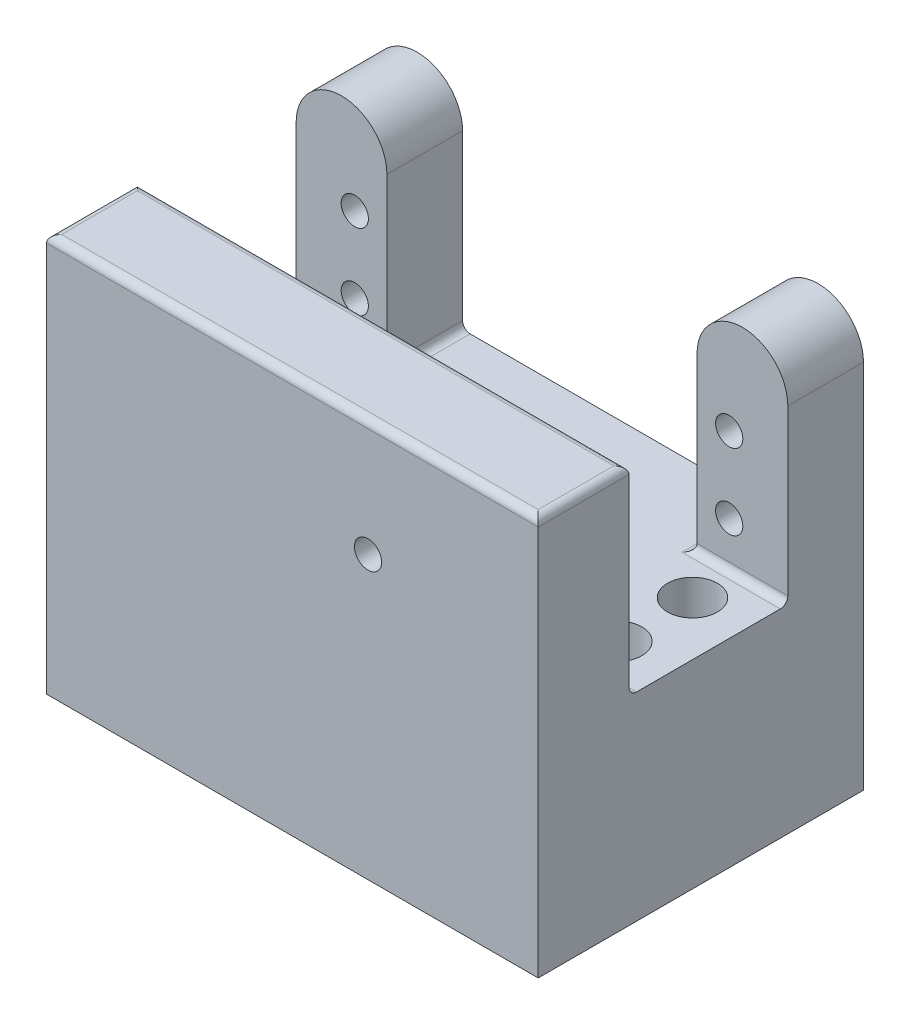
ISO-10303-21;
HEADER;
FILE_DESCRIPTION(('STEP AP214'),'2;1');
FILE_NAME('part.step','',(''),(''),'','','');
FILE_SCHEMA(('AUTOMOTIVE_DESIGN { 1 0 10303 214 1 1 1 1 }'));
ENDSEC;
DATA;
#1=APPLICATION_CONTEXT('core data for automotive mechanical design processes');
#2=APPLICATION_PROTOCOL_DEFINITION('international standard','automotive_design',2000,#1);
#3=PRODUCT_CONTEXT('',#1,'mechanical');
#4=PRODUCT('Part','Part','',(#3));
#5=PRODUCT_RELATED_PRODUCT_CATEGORY('part','',(#4));
#6=PRODUCT_DEFINITION_FORMATION('','',#4);
#7=PRODUCT_DEFINITION_CONTEXT('part definition',#1,'design');
#8=PRODUCT_DEFINITION('design','',#6,#7);
#9=PRODUCT_DEFINITION_SHAPE('','',#8);
#10=(LENGTH_UNIT() NAMED_UNIT(*) SI_UNIT(.MILLI.,.METRE.));
#11=(NAMED_UNIT(*) PLANE_ANGLE_UNIT() SI_UNIT($,.RADIAN.));
#12=(NAMED_UNIT(*) SI_UNIT($,.STERADIAN.) SOLID_ANGLE_UNIT());
#13=UNCERTAINTY_MEASURE_WITH_UNIT(LENGTH_MEASURE(1.E-05),#10,'distance_accuracy_value','');
#14=(GEOMETRIC_REPRESENTATION_CONTEXT(3) GLOBAL_UNCERTAINTY_ASSIGNED_CONTEXT((#13)) GLOBAL_UNIT_ASSIGNED_CONTEXT((#10,
#11,#12)) REPRESENTATION_CONTEXT('',''));
#15=CARTESIAN_POINT('',(0.,0.,0.));
#16=DIRECTION('',(0.,0.,1.));
#17=DIRECTION('',(1.,0.,0.));
#18=AXIS2_PLACEMENT_3D('',#15,#16,#17);
#19=CARTESIAN_POINT('',(0.,0.,31.));
#20=DIRECTION('',(0.,0.,1.));
#21=DIRECTION('',(1.,0.,0.));
#22=AXIS2_PLACEMENT_3D('',#19,#20,#21);
#23=PLANE('',#22);
#24=CARTESIAN_POINT('',(-16.5,2.55301226726425,31.));
#25=DIRECTION('',(0.,0.,1.));
#26=DIRECTION('',(1.,0.,0.));
#27=AXIS2_PLACEMENT_3D('',#24,#25,#26);
#28=CIRCLE('',#27,1.79999999999999);
#29=CARTESIAN_POINT('',(-14.7,2.55301226726425,31.));
#30=VERTEX_POINT('',#29);
#31=EDGE_CURVE('E363',#30,#30,#28,.T.);
#32=ORIENTED_EDGE('',*,*,#31,.T.);
#33=EDGE_LOOP('',(#32));
#34=FACE_BOUND('',#33,.T.);
#35=DIRECTION('',(0.,-1.,0.));
#36=VECTOR('',#35,1.);
#37=CARTESIAN_POINT('',(-59.,-20.6976744186047,31.));
#38=LINE('',#37,#36);
#39=CARTESIAN_POINT('',(-59.,16.9392946847438,31.));
#40=VERTEX_POINT('',#39);
#41=CARTESIAN_POINT('',(-59.,-7.44767441860465,31.));
#42=VERTEX_POINT('',#41);
#43=EDGE_CURVE('E251',#40,#42,#38,.T.);
#44=ORIENTED_EDGE('',*,*,#43,.F.);
#45=DIRECTION('',(-1.,0.,0.));
#46=VECTOR('',#45,1.);
#47=CARTESIAN_POINT('',(0.,16.9392946847438,31.));
#48=LINE('',#47,#46);
#49=CARTESIAN_POINT('',(6.00000000000001,16.9392946847438,31.));
#50=VERTEX_POINT('',#49);
#51=EDGE_CURVE('E294',#40,#50,#48,.F.);
#52=ORIENTED_EDGE('',*,*,#51,.T.);
#53=DIRECTION('',(0.,1.,0.));
#54=VECTOR('',#53,1.);
#55=CARTESIAN_POINT('',(6.00000000000001,-20.6976744186046,31.));
#56=LINE('',#55,#54);
#57=CARTESIAN_POINT('',(6.00000000000001,-7.44767441860465,31.));
#58=VERTEX_POINT('',#57);
#59=EDGE_CURVE('E246',#58,#50,#56,.T.);
#60=ORIENTED_EDGE('',*,*,#59,.F.);
#61=DIRECTION('',(1.,0.,0.));
#62=VECTOR('',#61,1.);
#63=CARTESIAN_POINT('',(0.,-7.44767441860465,31.));
#64=LINE('',#63,#62);
#65=EDGE_CURVE('E292',#58,#42,#64,.F.);
#66=ORIENTED_EDGE('',*,*,#65,.T.);
#67=EDGE_LOOP('',(#44,#52,#60,#66));
#68=FACE_BOUND('',#67,.T.);
#69=ADVANCED_FACE('F37',(#34,#68),#23,.F.);
#70=CARTESIAN_POINT('',(-6.,14.3023255813954,10.));
#71=DIRECTION('',(1.,0.,0.));
#72=DIRECTION('',(0.,1.,0.));
#73=AXIS2_PLACEMENT_3D('',#70,#71,#72);
#74=PLANE('',#73);
#75=DIRECTION('',(0.,-1.,0.));
#76=VECTOR('',#75,1.);
#77=CARTESIAN_POINT('',(-6.,14.3023255813954,0.));
#78=LINE('',#77,#76);
#79=CARTESIAN_POINT('',(-6.,14.3023255813954,0.));
#80=VERTEX_POINT('',#79);
#81=CARTESIAN_POINT('',(-6.,-7.44767441860465,0.));
#82=VERTEX_POINT('',#81);
#83=EDGE_CURVE('E272',#80,#82,#78,.T.);
#84=ORIENTED_EDGE('',*,*,#83,.T.);
#85=DIRECTION('',(0.,0.,1.));
#86=VECTOR('',#85,1.);
#87=CARTESIAN_POINT('',(-6.,-7.44767441860465,10.));
#88=LINE('',#87,#86);
#89=CARTESIAN_POINT('',(-6.,-7.44767441860465,10.));
#90=VERTEX_POINT('',#89);
#91=EDGE_CURVE('E317',#82,#90,#88,.T.);
#92=ORIENTED_EDGE('',*,*,#91,.T.);
#93=DIRECTION('',(0.,-1.,0.));
#94=VECTOR('',#93,1.);
#95=CARTESIAN_POINT('',(-6.,14.3023255813954,10.));
#96=LINE('',#95,#94);
#97=CARTESIAN_POINT('',(-6.,14.3023255813954,10.));
#98=VERTEX_POINT('',#97);
#99=EDGE_CURVE('E264',#98,#90,#96,.T.);
#100=ORIENTED_EDGE('',*,*,#99,.F.);
#101=DIRECTION('',(0.,0.,-1.));
#102=VECTOR('',#101,1.);
#103=CARTESIAN_POINT('',(-6.,14.3023255813954,10.));
#104=LINE('',#103,#102);
#105=EDGE_CURVE('E277',#98,#80,#104,.T.);
#106=ORIENTED_EDGE('',*,*,#105,.T.);
#107=EDGE_LOOP('',(#84,#92,#100,#106));
#108=FACE_BOUND('',#107,.T.);
#109=ADVANCED_FACE('F417',(#108),#74,.F.);
#110=CARTESIAN_POINT('',(-47.,-20.6976744186046,31.));
#111=DIRECTION('',(-1.,0.,0.));
#112=DIRECTION('',(0.,0.,1.));
#113=AXIS2_PLACEMENT_3D('',#110,#111,#112);
#114=PLANE('',#113);
#115=DIRECTION('',(0.,-1.,0.));
#116=VECTOR('',#115,1.);
#117=CARTESIAN_POINT('',(-47.,14.3023255813954,10.));
#118=LINE('',#117,#116);
#119=CARTESIAN_POINT('',(-47.,14.3023255813954,10.));
#120=VERTEX_POINT('',#119);
#121=CARTESIAN_POINT('',(-47.,-7.44767441860465,10.));
#122=VERTEX_POINT('',#121);
#123=EDGE_CURVE('E236',#120,#122,#118,.T.);
#124=ORIENTED_EDGE('',*,*,#123,.T.);
#125=DIRECTION('',(0.,0.,1.));
#126=VECTOR('',#125,1.);
#127=CARTESIAN_POINT('',(-47.,-7.44767441860465,31.));
#128=LINE('',#127,#126);
#129=CARTESIAN_POINT('',(-47.,-7.44767441860465,0.));
#130=VERTEX_POINT('',#129);
#131=EDGE_CURVE('E54',#122,#130,#128,.F.);
#132=ORIENTED_EDGE('',*,*,#131,.T.);
#133=DIRECTION('',(0.,-1.,0.));
#134=VECTOR('',#133,1.);
#135=CARTESIAN_POINT('',(-47.,14.3023255813954,0.));
#136=LINE('',#135,#134);
#137=CARTESIAN_POINT('',(-47.,14.3023255813954,0.));
#138=VERTEX_POINT('',#137);
#139=EDGE_CURVE('E176',#138,#130,#136,.T.);
#140=ORIENTED_EDGE('',*,*,#139,.F.);
#141=DIRECTION('',(0.,0.,-1.));
#142=VECTOR('',#141,1.);
#143=CARTESIAN_POINT('',(-47.,14.3023255813954,10.));
#144=LINE('',#143,#142);
#145=EDGE_CURVE('E238',#120,#138,#144,.T.);
#146=ORIENTED_EDGE('',*,*,#145,.F.);
#147=EDGE_LOOP('',(#124,#132,#140,#146));
#148=FACE_BOUND('',#147,.T.);
#149=ADVANCED_FACE('F424',(#148),#114,.F.);
#150=CARTESIAN_POINT('',(0.,14.3023255813954,10.));
#151=DIRECTION('',(0.,0.,-1.));
#152=DIRECTION('',(-1.,0.,0.));
#153=AXIS2_PLACEMENT_3D('',#150,#151,#152);
#154=CYLINDRICAL_SURFACE('',#153,6.);
#155=CARTESIAN_POINT('',(0.,14.3023255813954,0.));
#156=DIRECTION('',(0.,0.,1.));
#157=DIRECTION('',(-1.,0.,0.));
#158=AXIS2_PLACEMENT_3D('',#155,#156,#157);
#159=CIRCLE('',#158,6.);
#160=CARTESIAN_POINT('',(6.,14.3023255813954,0.));
#161=VERTEX_POINT('',#160);
#162=EDGE_CURVE('E260',#161,#80,#159,.T.);
#163=ORIENTED_EDGE('',*,*,#162,.T.);
#164=ORIENTED_EDGE('',*,*,#105,.F.);
#165=CARTESIAN_POINT('',(0.,14.3023255813954,10.));
#166=DIRECTION('',(0.,0.,1.));
#167=DIRECTION('',(-1.,0.,0.));
#168=AXIS2_PLACEMENT_3D('',#165,#166,#167);
#169=CIRCLE('',#168,6.);
#170=CARTESIAN_POINT('',(6.,14.3023255813954,10.));
#171=VERTEX_POINT('',#170);
#172=EDGE_CURVE('E261',#171,#98,#169,.T.);
#173=ORIENTED_EDGE('',*,*,#172,.F.);
#174=DIRECTION('',(0.,0.,-1.));
#175=VECTOR('',#174,1.);
#176=CARTESIAN_POINT('',(6.,14.3023255813954,10.));
#177=LINE('',#176,#175);
#178=EDGE_CURVE('E269',#171,#161,#177,.T.);
#179=ORIENTED_EDGE('',*,*,#178,.T.);
#180=EDGE_LOOP('',(#163,#164,#173,#179));
#181=FACE_BOUND('',#180,.T.);
#182=ADVANCED_FACE('F430',(#181),#154,.T.);
#183=CARTESIAN_POINT('',(6.,14.3023255813954,10.));
#184=DIRECTION('',(-1.,0.,0.));
#185=DIRECTION('',(0.,-1.,0.));
#186=AXIS2_PLACEMENT_3D('',#183,#184,#185);
#187=PLANE('',#186);
#188=ORIENTED_EDGE('',*,*,#59,.T.);
#189=DIRECTION('',(0.,0.,-1.));
#190=VECTOR('',#189,1.);
#191=CARTESIAN_POINT('',(6.,16.9392946847438,10.));
#192=LINE('',#191,#190);
#193=CARTESIAN_POINT('',(6.00000000000001,16.9392946847438,43.));
#194=VERTEX_POINT('',#193);
#195=EDGE_CURVE('E296',#50,#194,#192,.F.);
#196=ORIENTED_EDGE('',*,*,#195,.T.);
#197=DIRECTION('',(0.,1.,0.));
#198=VECTOR('',#197,1.);
#199=CARTESIAN_POINT('',(6.00000000000001,-20.6976744186046,43.));
#200=LINE('',#199,#198);
#201=CARTESIAN_POINT('',(6.00000000000001,-34.6976744186046,43.));
#202=VERTEX_POINT('',#201);
#203=EDGE_CURVE('E247',#202,#194,#200,.T.);
#204=ORIENTED_EDGE('',*,*,#203,.F.);
#205=DIRECTION('',(0.,0.,1.));
#206=VECTOR('',#205,1.);
#207=CARTESIAN_POINT('',(6.00000000000001,-34.6976744186046,43.));
#208=LINE('',#207,#206);
#209=CARTESIAN_POINT('',(6.00000000000001,-34.6976744186046,0.));
#210=VERTEX_POINT('',#209);
#211=EDGE_CURVE('E188',#210,#202,#208,.T.);
#212=ORIENTED_EDGE('',*,*,#211,.F.);
#213=DIRECTION('',(0.,1.,0.));
#214=VECTOR('',#213,1.);
#215=CARTESIAN_POINT('',(6.,14.3023255813954,0.));
#216=LINE('',#215,#214);
#217=EDGE_CURVE('E184',#210,#161,#216,.T.);
#218=ORIENTED_EDGE('',*,*,#217,.T.);
#219=ORIENTED_EDGE('',*,*,#178,.F.);
#220=DIRECTION('',(0.,1.,0.));
#221=VECTOR('',#220,1.);
#222=CARTESIAN_POINT('',(6.,14.3023255813954,10.));
#223=LINE('',#222,#221);
#224=CARTESIAN_POINT('',(6.,-7.44767441860465,10.));
#225=VERTEX_POINT('',#224);
#226=EDGE_CURVE('E267',#225,#171,#223,.T.);
#227=ORIENTED_EDGE('',*,*,#226,.F.);
#228=CARTESIAN_POINT('',(6.,-7.44767441860465,11.));
#229=DIRECTION('',(-1.,0.,0.));
#230=DIRECTION('',(0.,-1.,0.));
#231=AXIS2_PLACEMENT_3D('',#228,#229,#230);
#232=CIRCLE('',#231,1.);
#233=CARTESIAN_POINT('',(6.00000000000001,-8.44767441860465,11.));
#234=VERTEX_POINT('',#233);
#235=EDGE_CURVE('E322',#225,#234,#232,.T.);
#236=ORIENTED_EDGE('',*,*,#235,.T.);
#237=DIRECTION('',(0.,0.,-1.));
#238=VECTOR('',#237,1.);
#239=CARTESIAN_POINT('',(6.00000000000001,-8.44767441860465,31.));
#240=LINE('',#239,#238);
#241=CARTESIAN_POINT('',(6.00000000000001,-8.44767441860465,30.));
#242=VERTEX_POINT('',#241);
#243=EDGE_CURVE('E253',#242,#234,#240,.T.);
#244=ORIENTED_EDGE('',*,*,#243,.F.);
#245=CARTESIAN_POINT('',(6.00000000000001,-7.44767441860465,30.));
#246=DIRECTION('',(-1.,0.,0.));
#247=DIRECTION('',(0.,-1.,0.));
#248=AXIS2_PLACEMENT_3D('',#245,#246,#247);
#249=CIRCLE('',#248,1.);
#250=EDGE_CURVE('E46',#242,#58,#249,.T.);
#251=ORIENTED_EDGE('',*,*,#250,.T.);
#252=EDGE_LOOP('',(#188,#196,#204,#212,#218,#219,#227,#236,#244,#251));
#253=FACE_BOUND('',#252,.T.);
#254=ADVANCED_FACE('F620',(#253),#187,.F.);
#255=CARTESIAN_POINT('',(0.,14.3023255813954,10.));
#256=DIRECTION('',(0.,0.,-1.));
#257=DIRECTION('',(-1.,0.,0.));
#258=AXIS2_PLACEMENT_3D('',#255,#256,#257);
#259=PLANE('',#258);
#260=CARTESIAN_POINT('',(-1.75,7.55218083966562,10.));
#261=DIRECTION('',(0.,0.,-1.));
#262=DIRECTION('',(-1.,0.,0.));
#263=AXIS2_PLACEMENT_3D('',#260,#261,#262);
#264=CIRCLE('',#263,1.8);
#265=CARTESIAN_POINT('',(-3.55,7.55218083966562,10.));
#266=VERTEX_POINT('',#265);
#267=EDGE_CURVE('E208',#266,#266,#264,.F.);
#268=ORIENTED_EDGE('',*,*,#267,.F.);
#269=EDGE_LOOP('',(#268));
#270=FACE_BOUND('',#269,.T.);
#271=CARTESIAN_POINT('',(-1.75,-2.44781916033438,10.));
#272=DIRECTION('',(0.,0.,-1.));
#273=DIRECTION('',(-1.,0.,0.));
#274=AXIS2_PLACEMENT_3D('',#271,#272,#273);
#275=CIRCLE('',#274,1.8);
#276=CARTESIAN_POINT('',(-3.55,-2.44781916033438,10.));
#277=VERTEX_POINT('',#276);
#278=EDGE_CURVE('E214',#277,#277,#275,.F.);
#279=ORIENTED_EDGE('',*,*,#278,.F.);
#280=EDGE_LOOP('',(#279));
#281=FACE_BOUND('',#280,.T.);
#282=ORIENTED_EDGE('',*,*,#99,.T.);
#283=DIRECTION('',(1.,0.,0.));
#284=VECTOR('',#283,1.);
#285=CARTESIAN_POINT('',(0.,-7.44767441860465,10.));
#286=LINE('',#285,#284);
#287=EDGE_CURVE('E314',#90,#225,#286,.T.);
#288=ORIENTED_EDGE('',*,*,#287,.T.);
#289=ORIENTED_EDGE('',*,*,#226,.T.);
#290=ORIENTED_EDGE('',*,*,#172,.T.);
#291=EDGE_LOOP('',(#282,#288,#289,#290));
#292=FACE_BOUND('',#291,.T.);
#293=ADVANCED_FACE('F608',(#270,#281,#292),#259,.F.);
#294=CARTESIAN_POINT('',(0.,14.3023255813954,0.));
#295=DIRECTION('',(0.,0.,-1.));
#296=DIRECTION('',(-1.,0.,0.));
#297=AXIS2_PLACEMENT_3D('',#294,#295,#296);
#298=PLANE('',#297);
#299=CARTESIAN_POINT('',(-1.75,7.55218083966562,0.));
#300=DIRECTION('',(0.,0.,-1.));
#301=DIRECTION('',(-1.,0.,0.));
#302=AXIS2_PLACEMENT_3D('',#299,#300,#301);
#303=CIRCLE('',#302,1.8);
#304=CARTESIAN_POINT('',(-3.55,7.55218083966562,0.));
#305=VERTEX_POINT('',#304);
#306=EDGE_CURVE('E207',#305,#305,#303,.T.);
#307=ORIENTED_EDGE('',*,*,#306,.F.);
#308=EDGE_LOOP('',(#307));
#309=FACE_BOUND('',#308,.T.);
#310=CARTESIAN_POINT('',(-1.75,-2.44781916033438,0.));
#311=DIRECTION('',(0.,0.,-1.));
#312=DIRECTION('',(-1.,0.,0.));
#313=AXIS2_PLACEMENT_3D('',#310,#311,#312);
#314=CIRCLE('',#313,1.8);
#315=CARTESIAN_POINT('',(-3.55,-2.44781916033438,0.));
#316=VERTEX_POINT('',#315);
#317=EDGE_CURVE('E211',#316,#316,#314,.T.);
#318=ORIENTED_EDGE('',*,*,#317,.F.);
#319=EDGE_LOOP('',(#318));
#320=FACE_BOUND('',#319,.T.);
#321=ORIENTED_EDGE('',*,*,#162,.F.);
#322=ORIENTED_EDGE('',*,*,#217,.F.);
#323=DIRECTION('',(1.,0.,0.));
#324=VECTOR('',#323,1.);
#325=CARTESIAN_POINT('',(-59.,-34.6976744186046,0.));
#326=LINE('',#325,#324);
#327=CARTESIAN_POINT('',(-59.,-34.6976744186046,0.));
#328=VERTEX_POINT('',#327);
#329=EDGE_CURVE('E180',#328,#210,#326,.T.);
#330=ORIENTED_EDGE('',*,*,#329,.F.);
#331=DIRECTION('',(0.,1.,0.));
#332=VECTOR('',#331,1.);
#333=CARTESIAN_POINT('',(-59.,14.3023255813954,0.));
#334=LINE('',#333,#332);
#335=CARTESIAN_POINT('',(-59.,14.3023255813954,0.));
#336=VERTEX_POINT('',#335);
#337=EDGE_CURVE('E166',#328,#336,#334,.T.);
#338=ORIENTED_EDGE('',*,*,#337,.T.);
#339=CARTESIAN_POINT('',(-53.,14.3023255813954,0.));
#340=DIRECTION('',(0.,0.,-1.));
#341=DIRECTION('',(1.,0.,0.));
#342=AXIS2_PLACEMENT_3D('',#339,#340,#341);
#343=CIRCLE('',#342,6.);
#344=EDGE_CURVE('E177',#336,#138,#343,.T.);
#345=ORIENTED_EDGE('',*,*,#344,.T.);
#346=ORIENTED_EDGE('',*,*,#139,.T.);
#347=CARTESIAN_POINT('',(-46.,-7.44767441860465,0.));
#348=DIRECTION('',(0.,0.,-1.));
#349=DIRECTION('',(-1.,0.,0.));
#350=AXIS2_PLACEMENT_3D('',#347,#348,#349);
#351=CIRCLE('',#350,1.);
#352=CARTESIAN_POINT('',(-46.,-8.44767441860465,0.));
#353=VERTEX_POINT('',#352);
#354=EDGE_CURVE('E325',#130,#353,#351,.F.);
#355=ORIENTED_EDGE('',*,*,#354,.T.);
#356=DIRECTION('',(1.,0.,0.));
#357=VECTOR('',#356,1.);
#358=CARTESIAN_POINT('',(-5.99999999999999,-8.44767441860465,0.));
#359=LINE('',#358,#357);
#360=CARTESIAN_POINT('',(-7.,-8.44767441860465,0.));
#361=VERTEX_POINT('',#360);
#362=EDGE_CURVE('E205',#353,#361,#359,.T.);
#363=ORIENTED_EDGE('',*,*,#362,.T.);
#364=CARTESIAN_POINT('',(-7.,-7.44767441860465,0.));
#365=DIRECTION('',(0.,0.,-1.));
#366=DIRECTION('',(-1.,0.,0.));
#367=AXIS2_PLACEMENT_3D('',#364,#365,#366);
#368=CIRCLE('',#367,1.);
#369=EDGE_CURVE('E62',#361,#82,#368,.F.);
#370=ORIENTED_EDGE('',*,*,#369,.T.);
#371=ORIENTED_EDGE('',*,*,#83,.F.);
#372=EDGE_LOOP('',(#321,#322,#330,#338,#345,#346,#355,#363,#370,#371));
#373=FACE_BOUND('',#372,.T.);
#374=CARTESIAN_POINT('',(-51.25,8.00000000000001,0.));
#375=DIRECTION('',(0.,0.,-1.));
#376=DIRECTION('',(-1.,0.,0.));
#377=AXIS2_PLACEMENT_3D('',#374,#375,#376);
#378=CIRCLE('',#377,1.8);
#379=CARTESIAN_POINT('',(-53.05,8.00000000000001,0.));
#380=VERTEX_POINT('',#379);
#381=EDGE_CURVE('E217',#380,#380,#378,.T.);
#382=ORIENTED_EDGE('',*,*,#381,.F.);
#383=EDGE_LOOP('',(#382));
#384=FACE_BOUND('',#383,.T.);
#385=CARTESIAN_POINT('',(-51.25,-1.99999999999999,0.));
#386=DIRECTION('',(0.,0.,-1.));
#387=DIRECTION('',(-1.,0.,0.));
#388=AXIS2_PLACEMENT_3D('',#385,#386,#387);
#389=CIRCLE('',#388,1.8);
#390=CARTESIAN_POINT('',(-53.05,-1.99999999999999,0.));
#391=VERTEX_POINT('',#390);
#392=EDGE_CURVE('E225',#391,#391,#389,.T.);
#393=ORIENTED_EDGE('',*,*,#392,.F.);
#394=EDGE_LOOP('',(#393));
#395=FACE_BOUND('',#394,.T.);
#396=ADVANCED_FACE('F182',(#309,#320,#373,#384,#395),#298,.T.);
#397=CARTESIAN_POINT('',(-5.99999999999999,-8.44767441860465,31.));
#398=DIRECTION('',(0.,1.,0.));
#399=DIRECTION('',(0.,0.,1.));
#400=AXIS2_PLACEMENT_3D('',#397,#398,#399);
#401=PLANE('',#400);
#402=CARTESIAN_POINT('',(-1.09999999999998,-8.44767441860465,15.5));
#403=DIRECTION('',(0.,1.,0.));
#404=DIRECTION('',(0.,0.,1.));
#405=AXIS2_PLACEMENT_3D('',#402,#403,#404);
#406=CIRCLE('',#405,3.29999999999998);
#407=CARTESIAN_POINT('',(-1.09999999999998,-8.44767441860465,18.8));
#408=VERTEX_POINT('',#407);
#409=EDGE_CURVE('E357',#408,#408,#406,.T.);
#410=ORIENTED_EDGE('',*,*,#409,.F.);
#411=EDGE_LOOP('',(#410));
#412=FACE_BOUND('',#411,.T.);
#413=CARTESIAN_POINT('',(-1.09999999999998,-8.44767441860465,25.5));
#414=DIRECTION('',(0.,1.,0.));
#415=DIRECTION('',(0.,0.,1.));
#416=AXIS2_PLACEMENT_3D('',#413,#414,#415);
#417=CIRCLE('',#416,3.29999999999998);
#418=CARTESIAN_POINT('',(-1.09999999999998,-8.44767441860465,28.8));
#419=VERTEX_POINT('',#418);
#420=EDGE_CURVE('E41',#419,#419,#417,.T.);
#421=ORIENTED_EDGE('',*,*,#420,.F.);
#422=EDGE_LOOP('',(#421));
#423=FACE_BOUND('',#422,.T.);
#424=CARTESIAN_POINT('',(-51.9,-8.44767441860465,15.5));
#425=DIRECTION('',(0.,1.,0.));
#426=DIRECTION('',(0.,0.,1.));
#427=AXIS2_PLACEMENT_3D('',#424,#425,#426);
#428=CIRCLE('',#427,3.29999999999999);
#429=CARTESIAN_POINT('',(-51.9,-8.44767441860465,18.8));
#430=VERTEX_POINT('',#429);
#431=EDGE_CURVE('E344',#430,#430,#428,.T.);
#432=ORIENTED_EDGE('',*,*,#431,.F.);
#433=EDGE_LOOP('',(#432));
#434=FACE_BOUND('',#433,.T.);
#435=CARTESIAN_POINT('',(-51.9,-8.44767441860465,25.5));
#436=DIRECTION('',(0.,1.,0.));
#437=DIRECTION('',(0.,0.,1.));
#438=AXIS2_PLACEMENT_3D('',#435,#436,#437);
#439=CIRCLE('',#438,3.29999999999999);
#440=CARTESIAN_POINT('',(-51.9,-8.44767441860465,28.8));
#441=VERTEX_POINT('',#440);
#442=EDGE_CURVE('E339',#441,#441,#439,.T.);
#443=ORIENTED_EDGE('',*,*,#442,.F.);
#444=EDGE_LOOP('',(#443));
#445=FACE_BOUND('',#444,.T.);
#446=ORIENTED_EDGE('',*,*,#243,.T.);
#447=DIRECTION('',(1.,0.,0.));
#448=VECTOR('',#447,1.);
#449=CARTESIAN_POINT('',(-5.99999999999999,-8.44767441860465,11.));
#450=LINE('',#449,#448);
#451=CARTESIAN_POINT('',(-7.,-8.44767441860465,11.));
#452=VERTEX_POINT('',#451);
#453=EDGE_CURVE('E310',#234,#452,#450,.F.);
#454=ORIENTED_EDGE('',*,*,#453,.T.);
#455=DIRECTION('',(0.,0.,1.));
#456=VECTOR('',#455,1.);
#457=CARTESIAN_POINT('',(-7.,-8.44767441860465,31.));
#458=LINE('',#457,#456);
#459=EDGE_CURVE('E308',#452,#361,#458,.F.);
#460=ORIENTED_EDGE('',*,*,#459,.T.);
#461=ORIENTED_EDGE('',*,*,#362,.F.);
#462=DIRECTION('',(0.,0.,1.));
#463=VECTOR('',#462,1.);
#464=CARTESIAN_POINT('',(-46.,-8.44767441860465,31.));
#465=LINE('',#464,#463);
#466=CARTESIAN_POINT('',(-46.,-8.44767441860465,11.));
#467=VERTEX_POINT('',#466);
#468=EDGE_CURVE('E303',#353,#467,#465,.T.);
#469=ORIENTED_EDGE('',*,*,#468,.T.);
#470=DIRECTION('',(-1.,0.,0.));
#471=VECTOR('',#470,1.);
#472=CARTESIAN_POINT('',(-5.99999999999999,-8.44767441860465,11.));
#473=LINE('',#472,#471);
#474=CARTESIAN_POINT('',(-59.,-8.44767441860465,11.));
#475=VERTEX_POINT('',#474);
#476=EDGE_CURVE('E305',#467,#475,#473,.T.);
#477=ORIENTED_EDGE('',*,*,#476,.T.);
#478=DIRECTION('',(0.,0.,-1.));
#479=VECTOR('',#478,1.);
#480=CARTESIAN_POINT('',(-59.,-8.44767441860465,31.));
#481=LINE('',#480,#479);
#482=CARTESIAN_POINT('',(-59.,-8.44767441860465,30.));
#483=VERTEX_POINT('',#482);
#484=EDGE_CURVE('E243',#483,#475,#481,.T.);
#485=ORIENTED_EDGE('',*,*,#484,.F.);
#486=DIRECTION('',(1.,0.,0.));
#487=VECTOR('',#486,1.);
#488=CARTESIAN_POINT('',(-5.99999999999999,-8.44767441860465,30.));
#489=LINE('',#488,#487);
#490=EDGE_CURVE('E300',#483,#242,#489,.T.);
#491=ORIENTED_EDGE('',*,*,#490,.T.);
#492=EDGE_LOOP('',(#446,#454,#460,#461,#469,#477,#485,#491));
#493=FACE_BOUND('',#492,.T.);
#494=ADVANCED_FACE('F407',(#412,#423,#434,#445,#493),#401,.T.);
#495=CARTESIAN_POINT('',(6.00000000000001,17.9392946847438,43.));
#496=DIRECTION('',(0.,-1.,0.));
#497=DIRECTION('',(1.,0.,0.));
#498=AXIS2_PLACEMENT_3D('',#495,#496,#497);
#499=PLANE('',#498);
#500=DIRECTION('',(-1.,0.,0.));
#501=VECTOR('',#500,1.);
#502=CARTESIAN_POINT('',(6.00000000000001,17.9392946847438,42.));
#503=LINE('',#502,#501);
#504=CARTESIAN_POINT('',(-58.,17.9392946847438,42.));
#505=VERTEX_POINT('',#504);
#506=CARTESIAN_POINT('',(5.,17.9392946847438,42.));
#507=VERTEX_POINT('',#506);
#508=EDGE_CURVE('E287',#505,#507,#503,.F.);
#509=ORIENTED_EDGE('',*,*,#508,.T.);
#510=DIRECTION('',(0.,0.,-1.));
#511=VECTOR('',#510,1.);
#512=CARTESIAN_POINT('',(5.,17.9392946847438,43.));
#513=LINE('',#512,#511);
#514=CARTESIAN_POINT('',(5.,17.9392946847438,32.));
#515=VERTEX_POINT('',#514);
#516=EDGE_CURVE('E290',#507,#515,#513,.T.);
#517=ORIENTED_EDGE('',*,*,#516,.T.);
#518=DIRECTION('',(-1.,0.,0.));
#519=VECTOR('',#518,1.);
#520=CARTESIAN_POINT('',(6.00000000000001,17.9392946847438,32.));
#521=LINE('',#520,#519);
#522=CARTESIAN_POINT('',(-58.,17.9392946847438,32.));
#523=VERTEX_POINT('',#522);
#524=EDGE_CURVE('E285',#515,#523,#521,.T.);
#525=ORIENTED_EDGE('',*,*,#524,.T.);
#526=DIRECTION('',(0.,0.,-1.));
#527=VECTOR('',#526,1.);
#528=CARTESIAN_POINT('',(-58.,17.9392946847438,43.));
#529=LINE('',#528,#527);
#530=EDGE_CURVE('E283',#523,#505,#529,.F.);
#531=ORIENTED_EDGE('',*,*,#530,.T.);
#532=EDGE_LOOP('',(#509,#517,#525,#531));
#533=FACE_BOUND('',#532,.T.);
#534=ADVANCED_FACE('F405',(#533),#499,.F.);
#535=CARTESIAN_POINT('',(-59.,-20.6976744186047,43.));
#536=DIRECTION('',(1.,0.,0.));
#537=DIRECTION('',(0.,0.,-1.));
#538=AXIS2_PLACEMENT_3D('',#535,#536,#537);
#539=PLANE('',#538);
#540=DIRECTION('',(0.,-1.,0.));
#541=VECTOR('',#540,1.);
#542=CARTESIAN_POINT('',(-59.,-20.6976744186047,43.));
#543=LINE('',#542,#541);
#544=CARTESIAN_POINT('',(-59.,16.9392946847438,43.));
#545=VERTEX_POINT('',#544);
#546=CARTESIAN_POINT('',(-59.,-34.6976744186046,43.));
#547=VERTEX_POINT('',#546);
#548=EDGE_CURVE('E250',#545,#547,#543,.T.);
#549=ORIENTED_EDGE('',*,*,#548,.F.);
#550=DIRECTION('',(0.,0.,-1.));
#551=VECTOR('',#550,1.);
#552=CARTESIAN_POINT('',(-59.,16.9392946847438,43.));
#553=LINE('',#552,#551);
#554=EDGE_CURVE('E298',#545,#40,#553,.T.);
#555=ORIENTED_EDGE('',*,*,#554,.T.);
#556=ORIENTED_EDGE('',*,*,#43,.T.);
#557=CARTESIAN_POINT('',(-59.,-7.44767441860465,30.));
#558=DIRECTION('',(1.,0.,0.));
#559=DIRECTION('',(0.,0.,-1.));
#560=AXIS2_PLACEMENT_3D('',#557,#558,#559);
#561=CIRCLE('',#560,1.);
#562=EDGE_CURVE('E11',#42,#483,#561,.T.);
#563=ORIENTED_EDGE('',*,*,#562,.T.);
#564=ORIENTED_EDGE('',*,*,#484,.T.);
#565=CARTESIAN_POINT('',(-59.,-7.44767441860465,11.));
#566=DIRECTION('',(1.,0.,0.));
#567=DIRECTION('',(0.,0.,-1.));
#568=AXIS2_PLACEMENT_3D('',#565,#566,#567);
#569=CIRCLE('',#568,1.);
#570=CARTESIAN_POINT('',(-59.,-7.44767441860465,10.));
#571=VERTEX_POINT('',#570);
#572=EDGE_CURVE('E320',#475,#571,#569,.T.);
#573=ORIENTED_EDGE('',*,*,#572,.T.);
#574=DIRECTION('',(0.,1.,0.));
#575=VECTOR('',#574,1.);
#576=CARTESIAN_POINT('',(-59.,14.3023255813954,10.));
#577=LINE('',#576,#575);
#578=CARTESIAN_POINT('',(-59.,14.3023255813954,10.));
#579=VERTEX_POINT('',#578);
#580=EDGE_CURVE('E234',#571,#579,#577,.T.);
#581=ORIENTED_EDGE('',*,*,#580,.T.);
#582=DIRECTION('',(0.,0.,-1.));
#583=VECTOR('',#582,1.);
#584=CARTESIAN_POINT('',(-59.,14.3023255813954,10.));
#585=LINE('',#584,#583);
#586=EDGE_CURVE('E173',#579,#336,#585,.T.);
#587=ORIENTED_EDGE('',*,*,#586,.T.);
#588=ORIENTED_EDGE('',*,*,#337,.F.);
#589=DIRECTION('',(0.,0.,-1.));
#590=VECTOR('',#589,1.);
#591=CARTESIAN_POINT('',(-59.,-34.6976744186046,43.));
#592=LINE('',#591,#590);
#593=EDGE_CURVE('E171',#547,#328,#592,.T.);
#594=ORIENTED_EDGE('',*,*,#593,.F.);
#595=EDGE_LOOP('',(#549,#555,#556,#563,#564,#573,#581,#587,#588,#594));
#596=FACE_BOUND('',#595,.T.);
#597=ADVANCED_FACE('F169',(#596),#539,.F.);
#598=CARTESIAN_POINT('',(0.,0.,43.));
#599=DIRECTION('',(0.,0.,1.));
#600=DIRECTION('',(1.,0.,0.));
#601=AXIS2_PLACEMENT_3D('',#598,#599,#600);
#602=PLANE('',#601);
#603=CARTESIAN_POINT('',(-16.5,2.55301226726425,43.));
#604=DIRECTION('',(0.,0.,1.));
#605=DIRECTION('',(1.,0.,0.));
#606=AXIS2_PLACEMENT_3D('',#603,#604,#605);
#607=CIRCLE('',#606,1.79999999999999);
#608=CARTESIAN_POINT('',(-14.7,2.55301226726425,43.));
#609=VERTEX_POINT('',#608);
#610=EDGE_CURVE('E366',#609,#609,#607,.T.);
#611=ORIENTED_EDGE('',*,*,#610,.F.);
#612=EDGE_LOOP('',(#611));
#613=FACE_BOUND('',#612,.T.);
#614=ORIENTED_EDGE('',*,*,#203,.T.);
#615=DIRECTION('',(-1.,0.,0.));
#616=VECTOR('',#615,1.);
#617=CARTESIAN_POINT('',(-59.,16.9392946847438,43.));
#618=LINE('',#617,#616);
#619=EDGE_CURVE('E280',#194,#545,#618,.T.);
#620=ORIENTED_EDGE('',*,*,#619,.T.);
#621=ORIENTED_EDGE('',*,*,#548,.T.);
#622=DIRECTION('',(-1.,0.,0.));
#623=VECTOR('',#622,1.);
#624=CARTESIAN_POINT('',(-59.,-34.6976744186046,43.));
#625=LINE('',#624,#623);
#626=EDGE_CURVE('E193',#202,#547,#625,.T.);
#627=ORIENTED_EDGE('',*,*,#626,.F.);
#628=EDGE_LOOP('',(#614,#620,#621,#627));
#629=FACE_BOUND('',#628,.T.);
#630=ADVANCED_FACE('F373',(#613,#629),#602,.T.);
#631=CARTESIAN_POINT('',(-53.,14.3023255813954,10.));
#632=DIRECTION('',(0.,0.,-1.));
#633=DIRECTION('',(1.,0.,0.));
#634=AXIS2_PLACEMENT_3D('',#631,#632,#633);
#635=PLANE('',#634);
#636=CARTESIAN_POINT('',(-51.25,8.00000000000001,10.));
#637=DIRECTION('',(0.,0.,-1.));
#638=DIRECTION('',(-1.,0.,0.));
#639=AXIS2_PLACEMENT_3D('',#636,#637,#638);
#640=CIRCLE('',#639,1.8);
#641=CARTESIAN_POINT('',(-53.05,8.00000000000001,10.));
#642=VERTEX_POINT('',#641);
#643=EDGE_CURVE('E222',#642,#642,#640,.T.);
#644=ORIENTED_EDGE('',*,*,#643,.T.);
#645=EDGE_LOOP('',(#644));
#646=FACE_BOUND('',#645,.T.);
#647=CARTESIAN_POINT('',(-51.25,-1.99999999999999,10.));
#648=DIRECTION('',(0.,0.,-1.));
#649=DIRECTION('',(-1.,0.,0.));
#650=AXIS2_PLACEMENT_3D('',#647,#648,#649);
#651=CIRCLE('',#650,1.8);
#652=CARTESIAN_POINT('',(-53.05,-1.99999999999999,10.));
#653=VERTEX_POINT('',#652);
#654=EDGE_CURVE('E228',#653,#653,#651,.T.);
#655=ORIENTED_EDGE('',*,*,#654,.T.);
#656=EDGE_LOOP('',(#655));
#657=FACE_BOUND('',#656,.T.);
#658=ORIENTED_EDGE('',*,*,#580,.F.);
#659=DIRECTION('',(-1.,0.,0.));
#660=VECTOR('',#659,1.);
#661=CARTESIAN_POINT('',(-53.,-7.44767441860465,10.));
#662=LINE('',#661,#660);
#663=EDGE_CURVE('E312',#571,#122,#662,.F.);
#664=ORIENTED_EDGE('',*,*,#663,.T.);
#665=ORIENTED_EDGE('',*,*,#123,.F.);
#666=CARTESIAN_POINT('',(-53.,14.3023255813954,10.));
#667=DIRECTION('',(0.,0.,-1.));
#668=DIRECTION('',(1.,0.,0.));
#669=AXIS2_PLACEMENT_3D('',#666,#667,#668);
#670=CIRCLE('',#669,6.);
#671=EDGE_CURVE('E231',#579,#120,#670,.T.);
#672=ORIENTED_EDGE('',*,*,#671,.F.);
#673=EDGE_LOOP('',(#658,#664,#665,#672));
#674=FACE_BOUND('',#673,.T.);
#675=ADVANCED_FACE('F376',(#646,#657,#674),#635,.F.);
#676=CARTESIAN_POINT('',(-53.,14.3023255813954,10.));
#677=DIRECTION('',(0.,0.,-1.));
#678=DIRECTION('',(-1.,0.,0.));
#679=AXIS2_PLACEMENT_3D('',#676,#677,#678);
#680=CYLINDRICAL_SURFACE('',#679,6.);
#681=ORIENTED_EDGE('',*,*,#344,.F.);
#682=ORIENTED_EDGE('',*,*,#586,.F.);
#683=ORIENTED_EDGE('',*,*,#671,.T.);
#684=ORIENTED_EDGE('',*,*,#145,.T.);
#685=EDGE_LOOP('',(#681,#682,#683,#684));
#686=FACE_BOUND('',#685,.T.);
#687=ADVANCED_FACE('F431',(#686),#680,.T.);
#688=CARTESIAN_POINT('',(-51.25,-1.99999999999999,0.));
#689=DIRECTION('',(0.,0.,-1.));
#690=DIRECTION('',(-1.,0.,0.));
#691=AXIS2_PLACEMENT_3D('',#688,#689,#690);
#692=CYLINDRICAL_SURFACE('',#691,1.8);
#693=ORIENTED_EDGE('',*,*,#654,.F.);
#694=EDGE_LOOP('',(#693));
#695=FACE_BOUND('',#694,.T.);
#696=ORIENTED_EDGE('',*,*,#392,.T.);
#697=EDGE_LOOP('',(#696));
#698=FACE_BOUND('',#697,.T.);
#699=ADVANCED_FACE('F434',(#695,#698),#692,.F.);
#700=CARTESIAN_POINT('',(-51.25,8.00000000000001,0.));
#701=DIRECTION('',(0.,0.,-1.));
#702=DIRECTION('',(-1.,0.,0.));
#703=AXIS2_PLACEMENT_3D('',#700,#701,#702);
#704=CYLINDRICAL_SURFACE('',#703,1.8);
#705=ORIENTED_EDGE('',*,*,#643,.F.);
#706=EDGE_LOOP('',(#705));
#707=FACE_BOUND('',#706,.T.);
#708=ORIENTED_EDGE('',*,*,#381,.T.);
#709=EDGE_LOOP('',(#708));
#710=FACE_BOUND('',#709,.T.);
#711=ADVANCED_FACE('F441',(#707,#710),#704,.F.);
#712=CARTESIAN_POINT('',(-1.75,-2.44781916033438,0.));
#713=DIRECTION('',(0.,0.,-1.));
#714=DIRECTION('',(-1.,0.,0.));
#715=AXIS2_PLACEMENT_3D('',#712,#713,#714);
#716=CYLINDRICAL_SURFACE('',#715,1.8);
#717=ORIENTED_EDGE('',*,*,#278,.T.);
#718=EDGE_LOOP('',(#717));
#719=FACE_BOUND('',#718,.T.);
#720=ORIENTED_EDGE('',*,*,#317,.T.);
#721=EDGE_LOOP('',(#720));
#722=FACE_BOUND('',#721,.T.);
#723=ADVANCED_FACE('F445',(#719,#722),#716,.F.);
#724=CARTESIAN_POINT('',(-1.75,7.55218083966562,0.));
#725=DIRECTION('',(0.,0.,-1.));
#726=DIRECTION('',(-1.,0.,0.));
#727=AXIS2_PLACEMENT_3D('',#724,#725,#726);
#728=CYLINDRICAL_SURFACE('',#727,1.8);
#729=ORIENTED_EDGE('',*,*,#267,.T.);
#730=EDGE_LOOP('',(#729));
#731=FACE_BOUND('',#730,.T.);
#732=ORIENTED_EDGE('',*,*,#306,.T.);
#733=EDGE_LOOP('',(#732));
#734=FACE_BOUND('',#733,.T.);
#735=ADVANCED_FACE('F449',(#731,#734),#728,.F.);
#736=CARTESIAN_POINT('',(0.,-34.6976744186046,0.));
#737=DIRECTION('',(0.,-1.,0.));
#738=DIRECTION('',(0.,0.,-1.));
#739=AXIS2_PLACEMENT_3D('',#736,#737,#738);
#740=PLANE('',#739);
#741=CARTESIAN_POINT('',(-1.09999999999998,-34.6976744186046,15.5));
#742=DIRECTION('',(0.,-1.,0.));
#743=DIRECTION('',(0.,0.,-1.));
#744=AXIS2_PLACEMENT_3D('',#741,#742,#743);
#745=CIRCLE('',#744,3.29999999999999);
#746=CARTESIAN_POINT('',(-1.09999999999998,-34.6976744186046,12.2));
#747=VERTEX_POINT('',#746);
#748=EDGE_CURVE('E360',#747,#747,#745,.T.);
#749=ORIENTED_EDGE('',*,*,#748,.F.);
#750=EDGE_LOOP('',(#749));
#751=FACE_BOUND('',#750,.T.);
#752=CARTESIAN_POINT('',(-1.09999999999998,-34.6976744186046,25.5));
#753=DIRECTION('',(0.,-1.,0.));
#754=DIRECTION('',(0.,0.,-1.));
#755=AXIS2_PLACEMENT_3D('',#752,#753,#754);
#756=CIRCLE('',#755,3.29999999999999);
#757=CARTESIAN_POINT('',(-1.09999999999998,-34.6976744186046,22.2));
#758=VERTEX_POINT('',#757);
#759=EDGE_CURVE('E354',#758,#758,#756,.T.);
#760=ORIENTED_EDGE('',*,*,#759,.F.);
#761=EDGE_LOOP('',(#760));
#762=FACE_BOUND('',#761,.T.);
#763=CARTESIAN_POINT('',(-51.9,-34.6976744186046,15.5));
#764=DIRECTION('',(0.,-1.,0.));
#765=DIRECTION('',(0.,0.,-1.));
#766=AXIS2_PLACEMENT_3D('',#763,#764,#765);
#767=CIRCLE('',#766,3.29999999999999);
#768=CARTESIAN_POINT('',(-51.9,-34.6976744186046,12.2));
#769=VERTEX_POINT('',#768);
#770=EDGE_CURVE('E348',#769,#769,#767,.T.);
#771=ORIENTED_EDGE('',*,*,#770,.F.);
#772=EDGE_LOOP('',(#771));
#773=FACE_BOUND('',#772,.T.);
#774=CARTESIAN_POINT('',(-51.9,-34.6976744186046,25.5));
#775=DIRECTION('',(0.,-1.,0.));
#776=DIRECTION('',(0.,0.,-1.));
#777=AXIS2_PLACEMENT_3D('',#774,#775,#776);
#778=CIRCLE('',#777,3.29999999999999);
#779=CARTESIAN_POINT('',(-51.9,-34.6976744186046,22.2));
#780=VERTEX_POINT('',#779);
#781=EDGE_CURVE('E200',#780,#780,#778,.T.);
#782=ORIENTED_EDGE('',*,*,#781,.F.);
#783=EDGE_LOOP('',(#782));
#784=FACE_BOUND('',#783,.T.);
#785=ORIENTED_EDGE('',*,*,#593,.T.);
#786=ORIENTED_EDGE('',*,*,#329,.T.);
#787=ORIENTED_EDGE('',*,*,#211,.T.);
#788=ORIENTED_EDGE('',*,*,#626,.T.);
#789=EDGE_LOOP('',(#785,#786,#787,#788));
#790=FACE_BOUND('',#789,.T.);
#791=ADVANCED_FACE('F191',(#751,#762,#773,#784,#790),#740,.T.);
#792=CARTESIAN_POINT('',(6.00000000000001,16.9392946847438,32.));
#793=DIRECTION('',(-1.,0.,0.));
#794=DIRECTION('',(0.,-1.,0.));
#795=AXIS2_PLACEMENT_3D('',#792,#793,#794);
#796=CYLINDRICAL_SURFACE('',#795,1.);
#797=CARTESIAN_POINT('',(-58.,16.9392946847438,32.));
#798=DIRECTION('',(0.707106781186547,0.,-0.707106781186547));
#799=DIRECTION('',(-0.707106781186547,0.,-0.707106781186547));
#800=AXIS2_PLACEMENT_3D('',#797,#798,#799);
#801=ELLIPSE('',#800,1.41421356237309,1.);
#802=EDGE_CURVE('E197',#523,#40,#801,.F.);
#803=ORIENTED_EDGE('',*,*,#802,.F.);
#804=ORIENTED_EDGE('',*,*,#524,.F.);
#805=CARTESIAN_POINT('',(5.,16.9392946847438,32.));
#806=DIRECTION('',(-0.707106781186547,0.,-0.707106781186547));
#807=DIRECTION('',(0.707106781186547,0.,-0.707106781186547));
#808=AXIS2_PLACEMENT_3D('',#805,#806,#807);
#809=ELLIPSE('',#808,1.41421356237309,1.);
#810=EDGE_CURVE('E194',#50,#515,#809,.F.);
#811=ORIENTED_EDGE('',*,*,#810,.F.);
#812=ORIENTED_EDGE('',*,*,#51,.F.);
#813=EDGE_LOOP('',(#803,#804,#811,#812));
#814=FACE_BOUND('',#813,.T.);
#815=ADVANCED_FACE('F402',(#814),#796,.T.);
#816=CARTESIAN_POINT('',(5.,16.9392946847438,43.));
#817=DIRECTION('',(0.,0.,-1.));
#818=DIRECTION('',(-1.,0.,0.));
#819=AXIS2_PLACEMENT_3D('',#816,#817,#818);
#820=CYLINDRICAL_SURFACE('',#819,1.);
#821=ORIENTED_EDGE('',*,*,#810,.T.);
#822=ORIENTED_EDGE('',*,*,#516,.F.);
#823=CARTESIAN_POINT('',(5.,16.9392946847438,42.));
#824=DIRECTION('',(0.707106781186547,0.,-0.707106781186547));
#825=DIRECTION('',(-0.707106781186547,0.,-0.707106781186547));
#826=AXIS2_PLACEMENT_3D('',#823,#824,#825);
#827=ELLIPSE('',#826,1.41421356237309,1.);
#828=EDGE_CURVE('E330',#194,#507,#827,.F.);
#829=ORIENTED_EDGE('',*,*,#828,.F.);
#830=ORIENTED_EDGE('',*,*,#195,.F.);
#831=EDGE_LOOP('',(#821,#822,#829,#830));
#832=FACE_BOUND('',#831,.T.);
#833=ADVANCED_FACE('F384',(#832),#820,.T.);
#834=CARTESIAN_POINT('',(-58.,16.9392946847438,43.));
#835=DIRECTION('',(0.,0.,-1.));
#836=DIRECTION('',(-1.,0.,0.));
#837=AXIS2_PLACEMENT_3D('',#834,#835,#836);
#838=CYLINDRICAL_SURFACE('',#837,1.);
#839=ORIENTED_EDGE('',*,*,#802,.T.);
#840=ORIENTED_EDGE('',*,*,#554,.F.);
#841=CARTESIAN_POINT('',(-58.,16.9392946847438,42.));
#842=DIRECTION('',(-0.707106781186547,0.,-0.707106781186547));
#843=DIRECTION('',(0.707106781186547,0.,-0.707106781186547));
#844=AXIS2_PLACEMENT_3D('',#841,#842,#843);
#845=ELLIPSE('',#844,1.41421356237309,1.);
#846=EDGE_CURVE('E328',#505,#545,#845,.F.);
#847=ORIENTED_EDGE('',*,*,#846,.F.);
#848=ORIENTED_EDGE('',*,*,#530,.F.);
#849=EDGE_LOOP('',(#839,#840,#847,#848));
#850=FACE_BOUND('',#849,.T.);
#851=ADVANCED_FACE('F392',(#850),#838,.T.);
#852=CARTESIAN_POINT('',(0.,16.9392946847438,42.));
#853=DIRECTION('',(1.,0.,0.));
#854=DIRECTION('',(0.,1.,0.));
#855=AXIS2_PLACEMENT_3D('',#852,#853,#854);
#856=CYLINDRICAL_SURFACE('',#855,1.);
#857=ORIENTED_EDGE('',*,*,#828,.T.);
#858=ORIENTED_EDGE('',*,*,#508,.F.);
#859=ORIENTED_EDGE('',*,*,#846,.T.);
#860=ORIENTED_EDGE('',*,*,#619,.F.);
#861=EDGE_LOOP('',(#857,#858,#859,#860));
#862=FACE_BOUND('',#861,.T.);
#863=ADVANCED_FACE('F387',(#862),#856,.T.);
#864=CARTESIAN_POINT('',(-46.,-7.44767441860465,31.));
#865=DIRECTION('',(0.,0.,1.));
#866=DIRECTION('',(1.,0.,0.));
#867=AXIS2_PLACEMENT_3D('',#864,#865,#866);
#868=CYLINDRICAL_SURFACE('',#867,1.);
#869=ORIENTED_EDGE('',*,*,#354,.F.);
#870=ORIENTED_EDGE('',*,*,#131,.F.);
#871=CARTESIAN_POINT('',(-46.,-7.44767441860465,11.));
#872=DIRECTION('',(-0.707106781186547,0.,0.707106781186547));
#873=DIRECTION('',(0.707106781186547,0.,0.707106781186547));
#874=AXIS2_PLACEMENT_3D('',#871,#872,#873);
#875=ELLIPSE('',#874,1.41421356237309,1.);
#876=EDGE_CURVE('E331',#467,#122,#875,.F.);
#877=ORIENTED_EDGE('',*,*,#876,.F.);
#878=ORIENTED_EDGE('',*,*,#468,.F.);
#879=EDGE_LOOP('',(#869,#870,#877,#878));
#880=FACE_BOUND('',#879,.T.);
#881=ADVANCED_FACE('F519',(#880),#868,.F.);
#882=CARTESIAN_POINT('',(-5.99999999999999,-7.44767441860465,11.));
#883=DIRECTION('',(-1.,0.,0.));
#884=DIRECTION('',(0.,0.,1.));
#885=AXIS2_PLACEMENT_3D('',#882,#883,#884);
#886=CYLINDRICAL_SURFACE('',#885,1.);
#887=ORIENTED_EDGE('',*,*,#876,.T.);
#888=ORIENTED_EDGE('',*,*,#663,.F.);
#889=ORIENTED_EDGE('',*,*,#572,.F.);
#890=ORIENTED_EDGE('',*,*,#476,.F.);
#891=EDGE_LOOP('',(#887,#888,#889,#890));
#892=FACE_BOUND('',#891,.T.);
#893=ADVANCED_FACE('F512',(#892),#886,.F.);
#894=CARTESIAN_POINT('',(-7.,-7.44767441860465,10.));
#895=DIRECTION('',(0.,0.,1.));
#896=DIRECTION('',(1.,0.,0.));
#897=AXIS2_PLACEMENT_3D('',#894,#895,#896);
#898=CYLINDRICAL_SURFACE('',#897,1.);
#899=ORIENTED_EDGE('',*,*,#369,.F.);
#900=ORIENTED_EDGE('',*,*,#459,.F.);
#901=CARTESIAN_POINT('',(-7.,-7.44767441860465,11.));
#902=DIRECTION('',(0.707106781186547,0.,0.707106781186547));
#903=DIRECTION('',(-0.707106781186547,0.,0.707106781186547));
#904=AXIS2_PLACEMENT_3D('',#901,#902,#903);
#905=ELLIPSE('',#904,1.41421356237309,1.);
#906=EDGE_CURVE('E337',#90,#452,#905,.F.);
#907=ORIENTED_EDGE('',*,*,#906,.F.);
#908=ORIENTED_EDGE('',*,*,#91,.F.);
#909=EDGE_LOOP('',(#899,#900,#907,#908));
#910=FACE_BOUND('',#909,.T.);
#911=ADVANCED_FACE('F504',(#910),#898,.F.);
#912=CARTESIAN_POINT('',(0.,-7.44767441860465,11.));
#913=DIRECTION('',(1.,0.,0.));
#914=DIRECTION('',(0.,0.,-1.));
#915=AXIS2_PLACEMENT_3D('',#912,#913,#914);
#916=CYLINDRICAL_SURFACE('',#915,1.);
#917=ORIENTED_EDGE('',*,*,#906,.T.);
#918=ORIENTED_EDGE('',*,*,#453,.F.);
#919=ORIENTED_EDGE('',*,*,#235,.F.);
#920=ORIENTED_EDGE('',*,*,#287,.F.);
#921=EDGE_LOOP('',(#917,#918,#919,#920));
#922=FACE_BOUND('',#921,.T.);
#923=ADVANCED_FACE('F496',(#922),#916,.F.);
#924=CARTESIAN_POINT('',(-5.99999999999999,-7.44767441860465,30.));
#925=DIRECTION('',(1.,0.,0.));
#926=DIRECTION('',(0.,0.,-1.));
#927=AXIS2_PLACEMENT_3D('',#924,#925,#926);
#928=CYLINDRICAL_SURFACE('',#927,1.);
#929=ORIENTED_EDGE('',*,*,#562,.F.);
#930=ORIENTED_EDGE('',*,*,#65,.F.);
#931=ORIENTED_EDGE('',*,*,#250,.F.);
#932=ORIENTED_EDGE('',*,*,#490,.F.);
#933=EDGE_LOOP('',(#929,#930,#931,#932));
#934=FACE_BOUND('',#933,.T.);
#935=ADVANCED_FACE('F39',(#934),#928,.F.);
#936=CARTESIAN_POINT('',(-51.9,-34.6976744186046,25.5));
#937=DIRECTION('',(0.,-1.,0.));
#938=DIRECTION('',(0.,0.,-1.));
#939=AXIS2_PLACEMENT_3D('',#936,#937,#938);
#940=CYLINDRICAL_SURFACE('',#939,3.29999999999999);
#941=ORIENTED_EDGE('',*,*,#442,.T.);
#942=EDGE_LOOP('',(#941));
#943=FACE_BOUND('',#942,.T.);
#944=ORIENTED_EDGE('',*,*,#781,.T.);
#945=EDGE_LOOP('',(#944));
#946=FACE_BOUND('',#945,.T.);
#947=ADVANCED_FACE('F457',(#943,#946),#940,.F.);
#948=CARTESIAN_POINT('',(-51.9,-34.6976744186046,15.5));
#949=DIRECTION('',(0.,-1.,0.));
#950=DIRECTION('',(0.,0.,-1.));
#951=AXIS2_PLACEMENT_3D('',#948,#949,#950);
#952=CYLINDRICAL_SURFACE('',#951,3.29999999999999);
#953=ORIENTED_EDGE('',*,*,#431,.T.);
#954=EDGE_LOOP('',(#953));
#955=FACE_BOUND('',#954,.T.);
#956=ORIENTED_EDGE('',*,*,#770,.T.);
#957=EDGE_LOOP('',(#956));
#958=FACE_BOUND('',#957,.T.);
#959=ADVANCED_FACE('F460',(#955,#958),#952,.F.);
#960=CARTESIAN_POINT('',(-1.09999999999998,-34.6976744186046,25.5));
#961=DIRECTION('',(0.,-1.,0.));
#962=DIRECTION('',(0.,0.,-1.));
#963=AXIS2_PLACEMENT_3D('',#960,#961,#962);
#964=CYLINDRICAL_SURFACE('',#963,3.29999999999998);
#965=ORIENTED_EDGE('',*,*,#420,.T.);
#966=EDGE_LOOP('',(#965));
#967=FACE_BOUND('',#966,.T.);
#968=ORIENTED_EDGE('',*,*,#759,.T.);
#969=EDGE_LOOP('',(#968));
#970=FACE_BOUND('',#969,.T.);
#971=ADVANCED_FACE('F463',(#967,#970),#964,.F.);
#972=CARTESIAN_POINT('',(-1.09999999999998,-34.6976744186046,15.5));
#973=DIRECTION('',(0.,-1.,0.));
#974=DIRECTION('',(0.,0.,-1.));
#975=AXIS2_PLACEMENT_3D('',#972,#973,#974);
#976=CYLINDRICAL_SURFACE('',#975,3.29999999999998);
#977=ORIENTED_EDGE('',*,*,#409,.T.);
#978=EDGE_LOOP('',(#977));
#979=FACE_BOUND('',#978,.T.);
#980=ORIENTED_EDGE('',*,*,#748,.T.);
#981=EDGE_LOOP('',(#980));
#982=FACE_BOUND('',#981,.T.);
#983=ADVANCED_FACE('F466',(#979,#982),#976,.F.);
#984=CARTESIAN_POINT('',(-16.5,2.55301226726425,0.));
#985=DIRECTION('',(0.,0.,1.));
#986=DIRECTION('',(1.,0.,0.));
#987=AXIS2_PLACEMENT_3D('',#984,#985,#986);
#988=CYLINDRICAL_SURFACE('',#987,1.79999999999999);
#989=ORIENTED_EDGE('',*,*,#610,.T.);
#990=EDGE_LOOP('',(#989));
#991=FACE_BOUND('',#990,.T.);
#992=ORIENTED_EDGE('',*,*,#31,.F.);
#993=EDGE_LOOP('',(#992));
#994=FACE_BOUND('',#993,.T.);
#995=ADVANCED_FACE('F370',(#991,#994),#988,.F.);
#996=CLOSED_SHELL('',(#69,#109,#149,#182,#254,#293,#396,#494,#534,#597,#630,#675,#687,#699,#711,
#723,#735,#791,#815,#833,#851,#863,#881,#893,#911,#923,#935,#947,#959,#971,#983,#995));
#997=MANIFOLD_SOLID_BREP('B2',#996);
#998=ADVANCED_BREP_SHAPE_REPRESENTATION('',(#18,#997),#14);
#999=SHAPE_DEFINITION_REPRESENTATION(#9,#998);
ENDSEC;
END-ISO-10303-21;
